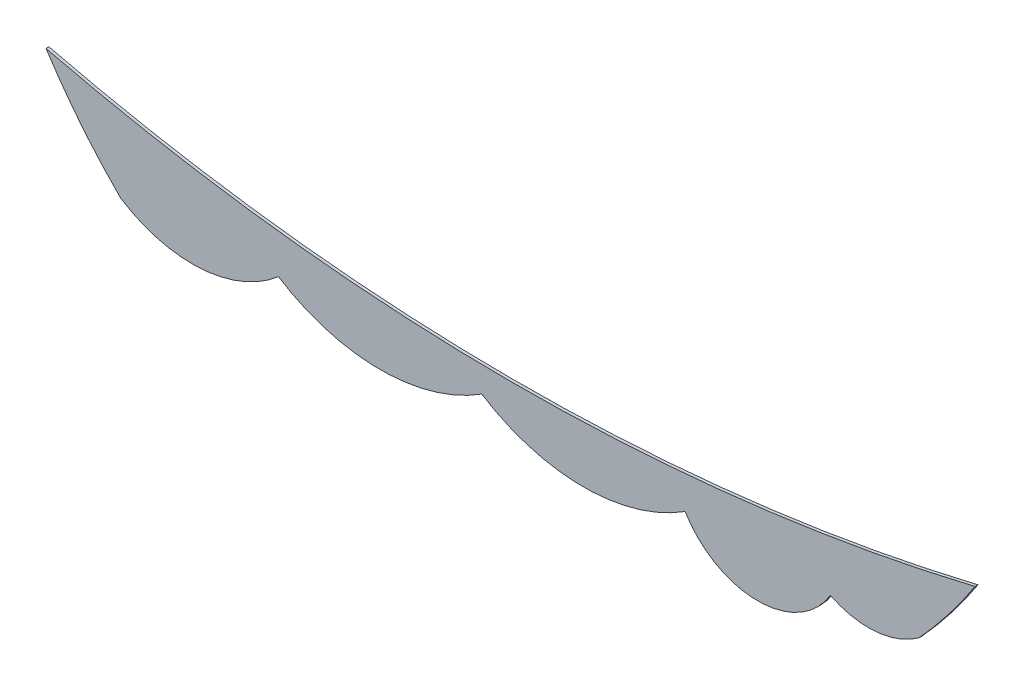
ISO-10303-21;
HEADER;
FILE_DESCRIPTION(('STEP AP214'),'2;1');
FILE_NAME('part.step','',(''),(''),'','','');
FILE_SCHEMA(('AUTOMOTIVE_DESIGN { 1 0 10303 214 1 1 1 1 }'));
ENDSEC;
DATA;
#1=APPLICATION_CONTEXT('core data for automotive mechanical design processes');
#2=APPLICATION_PROTOCOL_DEFINITION('international standard','automotive_design',2000,#1);
#3=PRODUCT_CONTEXT('',#1,'mechanical');
#4=PRODUCT('Part','Part','',(#3));
#5=PRODUCT_RELATED_PRODUCT_CATEGORY('part','',(#4));
#6=PRODUCT_DEFINITION_FORMATION('','',#4);
#7=PRODUCT_DEFINITION_CONTEXT('part definition',#1,'design');
#8=PRODUCT_DEFINITION('design','',#6,#7);
#9=PRODUCT_DEFINITION_SHAPE('','',#8);
#10=(LENGTH_UNIT() NAMED_UNIT(*) SI_UNIT(.MILLI.,.METRE.));
#11=(NAMED_UNIT(*) PLANE_ANGLE_UNIT() SI_UNIT($,.RADIAN.));
#12=(NAMED_UNIT(*) SI_UNIT($,.STERADIAN.) SOLID_ANGLE_UNIT());
#13=UNCERTAINTY_MEASURE_WITH_UNIT(LENGTH_MEASURE(1.E-05),#10,'distance_accuracy_value','');
#14=(GEOMETRIC_REPRESENTATION_CONTEXT(3) GLOBAL_UNCERTAINTY_ASSIGNED_CONTEXT((#13)) GLOBAL_UNIT_ASSIGNED_CONTEXT((#10,
#11,#12)) REPRESENTATION_CONTEXT('',''));
#15=CARTESIAN_POINT('',(0.,0.,0.));
#16=DIRECTION('',(0.,0.,1.));
#17=DIRECTION('',(1.,0.,0.));
#18=AXIS2_PLACEMENT_3D('',#15,#16,#17);
#19=CARTESIAN_POINT('',(34.9158782811661,30.0746903350287,0.1));
#20=DIRECTION('',(0.,0.,-1.));
#21=DIRECTION('',(-1.,0.,0.));
#22=AXIS2_PLACEMENT_3D('',#19,#20,#21);
#23=CYLINDRICAL_SURFACE('',#22,19.0394600163426);
#24=CARTESIAN_POINT('',(34.9158782811661,30.0746903350287,0.));
#25=DIRECTION('',(0.,0.,1.));
#26=DIRECTION('',(1.,0.,0.));
#27=AXIS2_PLACEMENT_3D('',#24,#25,#26);
#28=CIRCLE('',#27,19.0394600163426);
#29=CARTESIAN_POINT('',(18.9094241507859,19.7647696813115,0.));
#30=VERTEX_POINT('',#29);
#31=CARTESIAN_POINT('',(21.476433386907,16.5883135551785,0.));
#32=VERTEX_POINT('',#31);
#33=EDGE_CURVE('E130',#30,#32,#28,.T.);
#34=ORIENTED_EDGE('',*,*,#33,.T.);
#35=DIRECTION('',(0.,0.,-1.));
#36=VECTOR('',#35,1.);
#37=CARTESIAN_POINT('',(21.476433386907,16.5883135551785,0.1));
#38=LINE('',#37,#36);
#39=CARTESIAN_POINT('',(21.476433386907,16.5883135551785,0.1));
#40=VERTEX_POINT('',#39);
#41=EDGE_CURVE('E11',#40,#32,#38,.T.);
#42=ORIENTED_EDGE('',*,*,#41,.F.);
#43=CARTESIAN_POINT('',(34.9158782811661,30.0746903350287,0.1));
#44=DIRECTION('',(0.,0.,1.));
#45=DIRECTION('',(1.,0.,0.));
#46=AXIS2_PLACEMENT_3D('',#43,#44,#45);
#47=CIRCLE('',#46,19.0394600163426);
#48=CARTESIAN_POINT('',(18.9094241507859,19.7647696813115,0.1));
#49=VERTEX_POINT('',#48);
#50=EDGE_CURVE('E144',#49,#40,#47,.T.);
#51=ORIENTED_EDGE('',*,*,#50,.F.);
#52=DIRECTION('',(0.,0.,-1.));
#53=VECTOR('',#52,1.);
#54=CARTESIAN_POINT('',(18.9094241507859,19.7647696813115,0.1));
#55=LINE('',#54,#53);
#56=EDGE_CURVE('E126',#49,#30,#55,.T.);
#57=ORIENTED_EDGE('',*,*,#56,.T.);
#58=EDGE_LOOP('',(#34,#42,#51,#57));
#59=FACE_BOUND('',#58,.T.);
#60=ADVANCED_FACE('F34',(#59),#23,.T.);
#61=CARTESIAN_POINT('',(23.9449878251667,20.3962631055239,0.1));
#62=DIRECTION('',(0.,0.,-1.));
#63=DIRECTION('',(-1.,0.,0.));
#64=AXIS2_PLACEMENT_3D('',#61,#62,#63);
#65=CYLINDRICAL_SURFACE('',#64,4.5380877903173);
#66=CARTESIAN_POINT('',(23.9449878251667,20.3962631055239,0.));
#67=DIRECTION('',(0.,0.,1.));
#68=DIRECTION('',(1.,0.,0.));
#69=AXIS2_PLACEMENT_3D('',#66,#67,#68);
#70=CIRCLE('',#69,4.5380877903173);
#71=CARTESIAN_POINT('',(26.9094241507855,16.9602249706979,0.));
#72=VERTEX_POINT('',#71);
#73=EDGE_CURVE('E133',#32,#72,#70,.T.);
#74=ORIENTED_EDGE('',*,*,#73,.T.);
#75=DIRECTION('',(0.,0.,-1.));
#76=VECTOR('',#75,1.);
#77=CARTESIAN_POINT('',(26.9094241507855,16.9602249706979,0.1));
#78=LINE('',#77,#76);
#79=CARTESIAN_POINT('',(26.9094241507855,16.9602249706979,0.1));
#80=VERTEX_POINT('',#79);
#81=EDGE_CURVE('E42',#80,#72,#78,.T.);
#82=ORIENTED_EDGE('',*,*,#81,.F.);
#83=CARTESIAN_POINT('',(23.9449878251667,20.3962631055239,0.1));
#84=DIRECTION('',(0.,0.,1.));
#85=DIRECTION('',(1.,0.,0.));
#86=AXIS2_PLACEMENT_3D('',#83,#84,#85);
#87=CIRCLE('',#86,4.5380877903173);
#88=EDGE_CURVE('E93',#40,#80,#87,.T.);
#89=ORIENTED_EDGE('',*,*,#88,.F.);
#90=ORIENTED_EDGE('',*,*,#41,.T.);
#91=EDGE_LOOP('',(#74,#82,#89,#90));
#92=FACE_BOUND('',#91,.T.);
#93=ADVANCED_FACE('F179',(#92),#65,.T.);
#94=CARTESIAN_POINT('',(30.4094241507855,22.4602249706979,0.1));
#95=DIRECTION('',(0.,0.,-1.));
#96=DIRECTION('',(-1.,0.,0.));
#97=AXIS2_PLACEMENT_3D('',#94,#95,#96);
#98=CYLINDRICAL_SURFACE('',#97,6.51920240520263);
#99=CARTESIAN_POINT('',(30.4094241507855,22.4602249706979,0.));
#100=DIRECTION('',(0.,0.,1.));
#101=DIRECTION('',(1.,0.,0.));
#102=AXIS2_PLACEMENT_3D('',#99,#100,#101);
#103=CIRCLE('',#102,6.51920240520263);
#104=CARTESIAN_POINT('',(33.9094241507855,16.9602249706979,0.));
#105=VERTEX_POINT('',#104);
#106=EDGE_CURVE('E135',#72,#105,#103,.T.);
#107=ORIENTED_EDGE('',*,*,#106,.T.);
#108=DIRECTION('',(0.,0.,-1.));
#109=VECTOR('',#108,1.);
#110=CARTESIAN_POINT('',(33.9094241507855,16.9602249706979,0.1));
#111=LINE('',#110,#109);
#112=CARTESIAN_POINT('',(33.9094241507855,16.9602249706979,0.1));
#113=VERTEX_POINT('',#112);
#114=EDGE_CURVE('E151',#113,#105,#111,.T.);
#115=ORIENTED_EDGE('',*,*,#114,.F.);
#116=CARTESIAN_POINT('',(30.4094241507855,22.4602249706979,0.1));
#117=DIRECTION('',(0.,0.,1.));
#118=DIRECTION('',(1.,0.,0.));
#119=AXIS2_PLACEMENT_3D('',#116,#117,#118);
#120=CIRCLE('',#119,6.51920240520263);
#121=EDGE_CURVE('E159',#80,#113,#120,.T.);
#122=ORIENTED_EDGE('',*,*,#121,.F.);
#123=ORIENTED_EDGE('',*,*,#81,.T.);
#124=EDGE_LOOP('',(#107,#115,#122,#123));
#125=FACE_BOUND('',#124,.T.);
#126=ADVANCED_FACE('F157',(#125),#98,.T.);
#127=CARTESIAN_POINT('',(37.4094241507855,22.460224970698,0.1));
#128=DIRECTION('',(0.,0.,-1.));
#129=DIRECTION('',(-1.,0.,0.));
#130=AXIS2_PLACEMENT_3D('',#127,#128,#129);
#131=CYLINDRICAL_SURFACE('',#130,6.51920240520267);
#132=CARTESIAN_POINT('',(37.4094241507855,22.460224970698,0.));
#133=DIRECTION('',(0.,0.,1.));
#134=DIRECTION('',(1.,0.,0.));
#135=AXIS2_PLACEMENT_3D('',#132,#133,#134);
#136=CIRCLE('',#135,6.51920240520267);
#137=CARTESIAN_POINT('',(40.9094241507855,16.9602249706979,0.));
#138=VERTEX_POINT('',#137);
#139=EDGE_CURVE('E137',#105,#138,#136,.T.);
#140=ORIENTED_EDGE('',*,*,#139,.T.);
#141=DIRECTION('',(0.,0.,-1.));
#142=VECTOR('',#141,1.);
#143=CARTESIAN_POINT('',(40.9094241507855,16.9602249706979,0.1));
#144=LINE('',#143,#142);
#145=CARTESIAN_POINT('',(40.9094241507855,16.9602249706979,0.1));
#146=VERTEX_POINT('',#145);
#147=EDGE_CURVE('E148',#146,#138,#144,.T.);
#148=ORIENTED_EDGE('',*,*,#147,.F.);
#149=CARTESIAN_POINT('',(37.4094241507855,22.460224970698,0.1));
#150=DIRECTION('',(0.,0.,1.));
#151=DIRECTION('',(1.,0.,0.));
#152=AXIS2_PLACEMENT_3D('',#149,#150,#151);
#153=CIRCLE('',#152,6.51920240520267);
#154=EDGE_CURVE('E171',#113,#146,#153,.T.);
#155=ORIENTED_EDGE('',*,*,#154,.F.);
#156=ORIENTED_EDGE('',*,*,#114,.T.);
#157=EDGE_LOOP('',(#140,#148,#155,#156));
#158=FACE_BOUND('',#157,.T.);
#159=ADVANCED_FACE('F167',(#158),#131,.T.);
#160=CARTESIAN_POINT('',(43.4094241507855,18.4602249706979,0.1));
#161=DIRECTION('',(0.,0.,-1.));
#162=DIRECTION('',(-1.,0.,0.));
#163=AXIS2_PLACEMENT_3D('',#160,#161,#162);
#164=CYLINDRICAL_SURFACE('',#163,2.91547594742263);
#165=CARTESIAN_POINT('',(43.4094241507855,18.4602249706979,0.));
#166=DIRECTION('',(0.,0.,1.));
#167=DIRECTION('',(1.,0.,0.));
#168=AXIS2_PLACEMENT_3D('',#165,#166,#167);
#169=CIRCLE('',#168,2.91547594742263);
#170=CARTESIAN_POINT('',(45.9094241507855,16.9602249706979,0.));
#171=VERTEX_POINT('',#170);
#172=EDGE_CURVE('E139',#138,#171,#169,.T.);
#173=ORIENTED_EDGE('',*,*,#172,.T.);
#174=DIRECTION('',(0.,0.,-1.));
#175=VECTOR('',#174,1.);
#176=CARTESIAN_POINT('',(45.9094241507855,16.9602249706979,0.1));
#177=LINE('',#176,#175);
#178=CARTESIAN_POINT('',(45.9094241507855,16.9602249706979,0.1));
#179=VERTEX_POINT('',#178);
#180=EDGE_CURVE('E121',#179,#171,#177,.T.);
#181=ORIENTED_EDGE('',*,*,#180,.F.);
#182=CARTESIAN_POINT('',(43.4094241507855,18.4602249706979,0.1));
#183=DIRECTION('',(0.,0.,1.));
#184=DIRECTION('',(1.,0.,0.));
#185=AXIS2_PLACEMENT_3D('',#182,#183,#184);
#186=CIRCLE('',#185,2.91547594742263);
#187=EDGE_CURVE('E112',#146,#179,#186,.T.);
#188=ORIENTED_EDGE('',*,*,#187,.F.);
#189=ORIENTED_EDGE('',*,*,#147,.T.);
#190=EDGE_LOOP('',(#173,#181,#188,#189));
#191=FACE_BOUND('',#190,.T.);
#192=ADVANCED_FACE('F170',(#191),#164,.T.);
#193=CARTESIAN_POINT('',(47.2212095436313,19.5923748881483,0.1));
#194=DIRECTION('',(0.,0.,-1.));
#195=DIRECTION('',(-1.,0.,0.));
#196=AXIS2_PLACEMENT_3D('',#193,#194,#195);
#197=CYLINDRICAL_SURFACE('',#196,2.94091722168743);
#198=CARTESIAN_POINT('',(47.2212095436313,19.5923748881483,0.));
#199=DIRECTION('',(0.,0.,1.));
#200=DIRECTION('',(1.,0.,0.));
#201=AXIS2_PLACEMENT_3D('',#198,#199,#200);
#202=CIRCLE('',#201,2.94091722168743);
#203=CARTESIAN_POINT('',(48.9637430337526,17.2232883256472,0.));
#204=VERTEX_POINT('',#203);
#205=EDGE_CURVE('E120',#171,#204,#202,.T.);
#206=ORIENTED_EDGE('',*,*,#205,.T.);
#207=DIRECTION('',(0.,0.,-1.));
#208=VECTOR('',#207,1.);
#209=CARTESIAN_POINT('',(48.9637430337526,17.2232883256472,0.1));
#210=LINE('',#209,#208);
#211=CARTESIAN_POINT('',(48.9637430337526,17.2232883256472,0.1));
#212=VERTEX_POINT('',#211);
#213=EDGE_CURVE('E117',#212,#204,#210,.T.);
#214=ORIENTED_EDGE('',*,*,#213,.F.);
#215=CARTESIAN_POINT('',(47.2212095436313,19.5923748881483,0.1));
#216=DIRECTION('',(0.,0.,1.));
#217=DIRECTION('',(1.,0.,0.));
#218=AXIS2_PLACEMENT_3D('',#215,#216,#217);
#219=CIRCLE('',#218,2.94091722168743);
#220=EDGE_CURVE('E106',#179,#212,#219,.T.);
#221=ORIENTED_EDGE('',*,*,#220,.F.);
#222=ORIENTED_EDGE('',*,*,#180,.T.);
#223=EDGE_LOOP('',(#206,#214,#221,#222));
#224=FACE_BOUND('',#223,.T.);
#225=ADVANCED_FACE('F118',(#224),#197,.T.);
#226=CARTESIAN_POINT('',(34.9158782811661,30.0746903350287,0.1));
#227=DIRECTION('',(0.,0.,-1.));
#228=DIRECTION('',(-1.,0.,0.));
#229=AXIS2_PLACEMENT_3D('',#226,#227,#228);
#230=CYLINDRICAL_SURFACE('',#229,19.0394600163369);
#231=CARTESIAN_POINT('',(34.9158782811661,30.0746903350287,0.));
#232=DIRECTION('',(0.,0.,1.));
#233=DIRECTION('',(1.,0.,0.));
#234=AXIS2_PLACEMENT_3D('',#231,#232,#233);
#235=CIRCLE('',#234,19.0394600163369);
#236=CARTESIAN_POINT('',(50.8905758492143,19.7156326885492,0.));
#237=VERTEX_POINT('',#236);
#238=EDGE_CURVE('E79',#204,#237,#235,.T.);
#239=ORIENTED_EDGE('',*,*,#238,.T.);
#240=DIRECTION('',(0.,0.,-1.));
#241=VECTOR('',#240,1.);
#242=CARTESIAN_POINT('',(50.8905758492143,19.7156326885492,0.1));
#243=LINE('',#242,#241);
#244=CARTESIAN_POINT('',(50.8905758492143,19.7156326885492,0.1));
#245=VERTEX_POINT('',#244);
#246=EDGE_CURVE('E122',#245,#237,#243,.T.);
#247=ORIENTED_EDGE('',*,*,#246,.F.);
#248=CARTESIAN_POINT('',(34.9158782811661,30.0746903350287,0.1));
#249=DIRECTION('',(0.,0.,1.));
#250=DIRECTION('',(1.,0.,0.));
#251=AXIS2_PLACEMENT_3D('',#248,#249,#250);
#252=CIRCLE('',#251,19.0394600163369);
#253=EDGE_CURVE('E110',#212,#245,#252,.T.);
#254=ORIENTED_EDGE('',*,*,#253,.F.);
#255=ORIENTED_EDGE('',*,*,#213,.T.);
#256=EDGE_LOOP('',(#239,#247,#254,#255));
#257=FACE_BOUND('',#256,.T.);
#258=ADVANCED_FACE('F124',(#257),#230,.T.);
#259=CARTESIAN_POINT('',(35.0016516658285,85.9008911764577,0.1));
#260=DIRECTION('',(0.,0.,-1.));
#261=DIRECTION('',(-1.,0.,0.));
#262=AXIS2_PLACEMENT_3D('',#259,#260,#261);
#263=CYLINDRICAL_SURFACE('',#262,68.0657502185691);
#264=CARTESIAN_POINT('',(35.0016516658285,85.9008911764577,0.));
#265=DIRECTION('',(0.,0.,-1.));
#266=DIRECTION('',(1.,0.,0.));
#267=AXIS2_PLACEMENT_3D('',#264,#265,#266);
#268=CIRCLE('',#267,68.0657502185691);
#269=EDGE_CURVE('E85',#237,#30,#268,.T.);
#270=ORIENTED_EDGE('',*,*,#269,.T.);
#271=ORIENTED_EDGE('',*,*,#56,.F.);
#272=CARTESIAN_POINT('',(35.0016516658285,85.9008911764577,0.1));
#273=DIRECTION('',(0.,0.,-1.));
#274=DIRECTION('',(1.,0.,0.));
#275=AXIS2_PLACEMENT_3D('',#272,#273,#274);
#276=CIRCLE('',#275,68.0657502185691);
#277=EDGE_CURVE('E50',#245,#49,#276,.T.);
#278=ORIENTED_EDGE('',*,*,#277,.F.);
#279=ORIENTED_EDGE('',*,*,#246,.T.);
#280=EDGE_LOOP('',(#270,#271,#278,#279));
#281=FACE_BOUND('',#280,.T.);
#282=ADVANCED_FACE('F195',(#281),#263,.F.);
#283=CARTESIAN_POINT('',(29.4304330531664,25.2354767202763,0.1));
#284=DIRECTION('',(0.,0.,1.));
#285=DIRECTION('',(1.,0.,0.));
#286=AXIS2_PLACEMENT_3D('',#283,#284,#285);
#287=PLANE('',#286);
#288=ORIENTED_EDGE('',*,*,#50,.T.);
#289=ORIENTED_EDGE('',*,*,#88,.T.);
#290=ORIENTED_EDGE('',*,*,#121,.T.);
#291=ORIENTED_EDGE('',*,*,#154,.T.);
#292=ORIENTED_EDGE('',*,*,#187,.T.);
#293=ORIENTED_EDGE('',*,*,#220,.T.);
#294=ORIENTED_EDGE('',*,*,#253,.T.);
#295=ORIENTED_EDGE('',*,*,#277,.T.);
#296=EDGE_LOOP('',(#288,#289,#290,#291,#292,#293,#294,#295));
#297=FACE_BOUND('',#296,.T.);
#298=ADVANCED_FACE('F108',(#297),#287,.T.);
#299=CARTESIAN_POINT('',(29.4304330531664,25.2354767202763,0.));
#300=DIRECTION('',(0.,0.,1.));
#301=DIRECTION('',(1.,0.,0.));
#302=AXIS2_PLACEMENT_3D('',#299,#300,#301);
#303=PLANE('',#302);
#304=ORIENTED_EDGE('',*,*,#33,.F.);
#305=ORIENTED_EDGE('',*,*,#269,.F.);
#306=ORIENTED_EDGE('',*,*,#238,.F.);
#307=ORIENTED_EDGE('',*,*,#205,.F.);
#308=ORIENTED_EDGE('',*,*,#172,.F.);
#309=ORIENTED_EDGE('',*,*,#139,.F.);
#310=ORIENTED_EDGE('',*,*,#106,.F.);
#311=ORIENTED_EDGE('',*,*,#73,.F.);
#312=EDGE_LOOP('',(#304,#305,#306,#307,#308,#309,#310,#311));
#313=FACE_BOUND('',#312,.T.);
#314=ADVANCED_FACE('F163',(#313),#303,.F.);
#315=CLOSED_SHELL('',(#60,#93,#126,#159,#192,#225,#258,#282,#298,#314));
#316=MANIFOLD_SOLID_BREP('B2',#315);
#317=ADVANCED_BREP_SHAPE_REPRESENTATION('',(#18,#316),#14);
#318=SHAPE_DEFINITION_REPRESENTATION(#9,#317);
ENDSEC;
END-ISO-10303-21;
